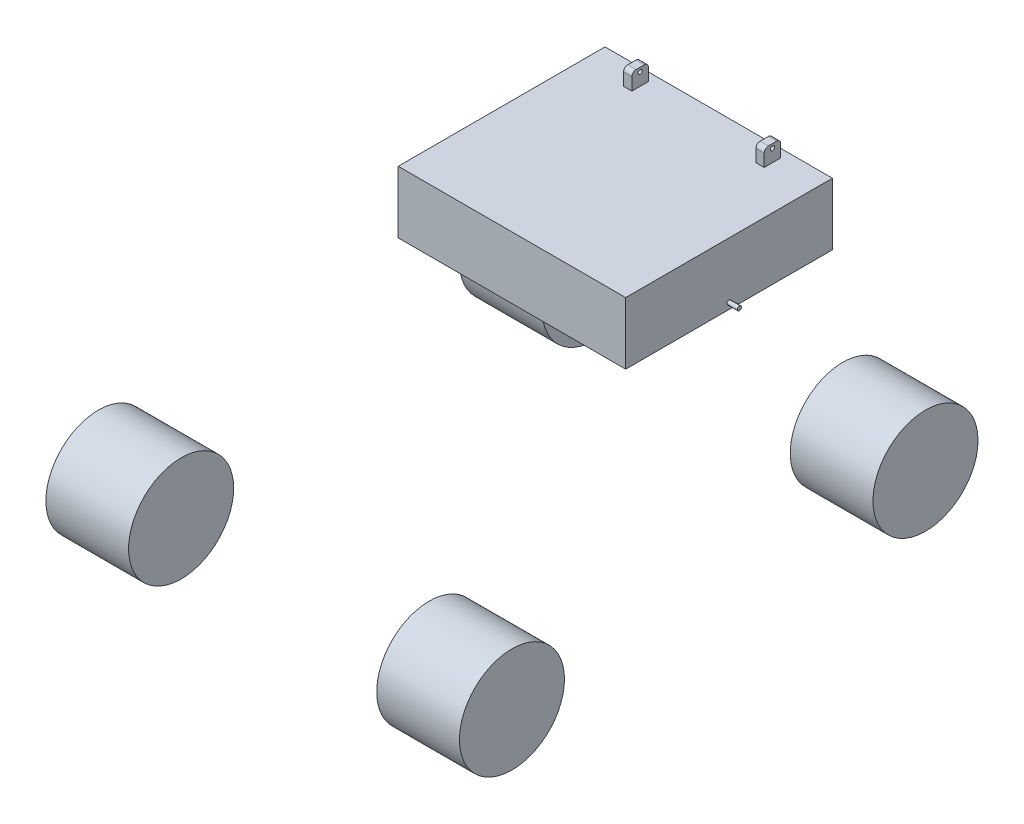
ISO-10303-21;
HEADER;
FILE_DESCRIPTION(('STEP AP214'),'2;1');
FILE_NAME('part.step','',(''),(''),'','','');
FILE_SCHEMA(('AUTOMOTIVE_DESIGN { 1 0 10303 214 1 1 1 1 }'));
ENDSEC;
DATA;
#1=APPLICATION_CONTEXT('core data for automotive mechanical design processes');
#2=APPLICATION_PROTOCOL_DEFINITION('international standard','automotive_design',2000,#1);
#3=PRODUCT_CONTEXT('',#1,'mechanical');
#4=PRODUCT('Part','Part','',(#3));
#5=PRODUCT_RELATED_PRODUCT_CATEGORY('part','',(#4));
#6=PRODUCT_DEFINITION_FORMATION('','',#4);
#7=PRODUCT_DEFINITION_CONTEXT('part definition',#1,'design');
#8=PRODUCT_DEFINITION('design','',#6,#7);
#9=PRODUCT_DEFINITION_SHAPE('','',#8);
#10=(LENGTH_UNIT() NAMED_UNIT(*) SI_UNIT(.MILLI.,.METRE.));
#11=(NAMED_UNIT(*) PLANE_ANGLE_UNIT() SI_UNIT($,.RADIAN.));
#12=(NAMED_UNIT(*) SI_UNIT($,.STERADIAN.) SOLID_ANGLE_UNIT());
#13=UNCERTAINTY_MEASURE_WITH_UNIT(LENGTH_MEASURE(1.E-05),#10,'distance_accuracy_value','');
#14=(GEOMETRIC_REPRESENTATION_CONTEXT(3) GLOBAL_UNCERTAINTY_ASSIGNED_CONTEXT((#13)) GLOBAL_UNIT_ASSIGNED_CONTEXT((#10,
#11,#12)) REPRESENTATION_CONTEXT('',''));
#15=CARTESIAN_POINT('',(0.,0.,0.));
#16=DIRECTION('',(0.,0.,1.));
#17=DIRECTION('',(1.,0.,0.));
#18=AXIS2_PLACEMENT_3D('',#15,#16,#17);
#19=CARTESIAN_POINT('',(275.,500.,0.));
#20=DIRECTION('',(0.,-1.,0.));
#21=DIRECTION('',(0.,0.,-1.));
#22=AXIS2_PLACEMENT_3D('',#19,#20,#21);
#23=PLANE('',#22);
#24=DIRECTION('',(0.,0.,1.));
#25=VECTOR('',#24,1.);
#26=CARTESIAN_POINT('',(-170.,500.,-440.));
#27=LINE('',#26,#25);
#28=CARTESIAN_POINT('',(-170.,500.,-480.));
#29=VERTEX_POINT('',#28);
#30=CARTESIAN_POINT('',(-170.,500.,-440.));
#31=VERTEX_POINT('',#30);
#32=EDGE_CURVE('E183',#29,#31,#27,.T.);
#33=ORIENTED_EDGE('',*,*,#32,.F.);
#34=DIRECTION('',(-1.,0.,0.));
#35=VECTOR('',#34,1.);
#36=CARTESIAN_POINT('',(-170.,500.,-480.));
#37=LINE('',#36,#35);
#38=CARTESIAN_POINT('',(-150.,500.,-480.));
#39=VERTEX_POINT('',#38);
#40=EDGE_CURVE('E202',#39,#29,#37,.T.);
#41=ORIENTED_EDGE('',*,*,#40,.F.);
#42=DIRECTION('',(0.,0.,-1.));
#43=VECTOR('',#42,1.);
#44=CARTESIAN_POINT('',(-150.,500.,-440.));
#45=LINE('',#44,#43);
#46=CARTESIAN_POINT('',(-150.,500.,-440.));
#47=VERTEX_POINT('',#46);
#48=EDGE_CURVE('E211',#47,#39,#45,.T.);
#49=ORIENTED_EDGE('',*,*,#48,.F.);
#50=DIRECTION('',(1.,0.,0.));
#51=VECTOR('',#50,1.);
#52=CARTESIAN_POINT('',(-170.,500.,-440.));
#53=LINE('',#52,#51);
#54=EDGE_CURVE('E208',#31,#47,#53,.T.);
#55=ORIENTED_EDGE('',*,*,#54,.F.);
#56=EDGE_LOOP('',(#33,#41,#49,#55));
#57=FACE_BOUND('',#56,.T.);
#58=DIRECTION('',(0.,0.,1.));
#59=VECTOR('',#58,1.);
#60=CARTESIAN_POINT('',(-275.,500.,0.));
#61=LINE('',#60,#59);
#62=CARTESIAN_POINT('',(-275.,500.,-500.));
#63=VERTEX_POINT('',#62);
#64=CARTESIAN_POINT('',(-275.,500.,0.));
#65=VERTEX_POINT('',#64);
#66=EDGE_CURVE('E237',#63,#65,#61,.T.);
#67=ORIENTED_EDGE('',*,*,#66,.T.);
#68=DIRECTION('',(-1.,0.,0.));
#69=VECTOR('',#68,1.);
#70=CARTESIAN_POINT('',(275.,500.,0.));
#71=LINE('',#70,#69);
#72=CARTESIAN_POINT('',(275.,500.,0.));
#73=VERTEX_POINT('',#72);
#74=EDGE_CURVE('E243',#73,#65,#71,.T.);
#75=ORIENTED_EDGE('',*,*,#74,.F.);
#76=DIRECTION('',(0.,0.,1.));
#77=VECTOR('',#76,1.);
#78=CARTESIAN_POINT('',(275.,500.,0.));
#79=LINE('',#78,#77);
#80=CARTESIAN_POINT('',(275.,500.,-500.));
#81=VERTEX_POINT('',#80);
#82=EDGE_CURVE('E241',#81,#73,#79,.T.);
#83=ORIENTED_EDGE('',*,*,#82,.F.);
#84=DIRECTION('',(-1.,0.,0.));
#85=VECTOR('',#84,1.);
#86=CARTESIAN_POINT('',(275.,500.,-500.));
#87=LINE('',#86,#85);
#88=EDGE_CURVE('E253',#81,#63,#87,.T.);
#89=ORIENTED_EDGE('',*,*,#88,.T.);
#90=EDGE_LOOP('',(#67,#75,#83,#89));
#91=FACE_BOUND('',#90,.T.);
#92=DIRECTION('',(0.,0.,1.));
#93=VECTOR('',#92,1.);
#94=CARTESIAN_POINT('',(150.,500.,-440.));
#95=LINE('',#94,#93);
#96=CARTESIAN_POINT('',(150.,500.,-480.));
#97=VERTEX_POINT('',#96);
#98=CARTESIAN_POINT('',(150.,500.,-440.));
#99=VERTEX_POINT('',#98);
#100=EDGE_CURVE('E166',#97,#99,#95,.T.);
#101=ORIENTED_EDGE('',*,*,#100,.F.);
#102=DIRECTION('',(-1.,0.,0.));
#103=VECTOR('',#102,1.);
#104=CARTESIAN_POINT('',(150.,500.,-480.));
#105=LINE('',#104,#103);
#106=CARTESIAN_POINT('',(170.,500.,-480.));
#107=VERTEX_POINT('',#106);
#108=EDGE_CURVE('E179',#107,#97,#105,.T.);
#109=ORIENTED_EDGE('',*,*,#108,.F.);
#110=DIRECTION('',(0.,0.,-1.));
#111=VECTOR('',#110,1.);
#112=CARTESIAN_POINT('',(170.,500.,-440.));
#113=LINE('',#112,#111);
#114=CARTESIAN_POINT('',(170.,500.,-440.));
#115=VERTEX_POINT('',#114);
#116=EDGE_CURVE('E187',#115,#107,#113,.T.);
#117=ORIENTED_EDGE('',*,*,#116,.F.);
#118=DIRECTION('',(1.,0.,0.));
#119=VECTOR('',#118,1.);
#120=CARTESIAN_POINT('',(150.,500.,-440.));
#121=LINE('',#120,#119);
#122=EDGE_CURVE('E182',#99,#115,#121,.T.);
#123=ORIENTED_EDGE('',*,*,#122,.F.);
#124=EDGE_LOOP('',(#101,#109,#117,#123));
#125=FACE_BOUND('',#124,.T.);
#126=ADVANCED_FACE('F49',(#57,#91,#125),#23,.F.);
#127=CARTESIAN_POINT('',(275.,500.,0.));
#128=DIRECTION('',(0.,0.,-1.));
#129=DIRECTION('',(0.,1.,0.));
#130=AXIS2_PLACEMENT_3D('',#127,#128,#129);
#131=PLANE('',#130);
#132=DIRECTION('',(0.,-1.,0.));
#133=VECTOR('',#132,1.);
#134=CARTESIAN_POINT('',(-275.,500.,0.));
#135=LINE('',#134,#133);
#136=CARTESIAN_POINT('',(-275.,350.,0.));
#137=VERTEX_POINT('',#136);
#138=EDGE_CURVE('E232',#65,#137,#135,.T.);
#139=ORIENTED_EDGE('',*,*,#138,.T.);
#140=DIRECTION('',(-1.,0.,0.));
#141=VECTOR('',#140,1.);
#142=CARTESIAN_POINT('',(275.,350.,0.));
#143=LINE('',#142,#141);
#144=CARTESIAN_POINT('',(275.,350.,0.));
#145=VERTEX_POINT('',#144);
#146=EDGE_CURVE('E259',#145,#137,#143,.T.);
#147=ORIENTED_EDGE('',*,*,#146,.F.);
#148=DIRECTION('',(0.,-1.,0.));
#149=VECTOR('',#148,1.);
#150=CARTESIAN_POINT('',(275.,500.,0.));
#151=LINE('',#150,#149);
#152=EDGE_CURVE('E233',#73,#145,#151,.T.);
#153=ORIENTED_EDGE('',*,*,#152,.F.);
#154=ORIENTED_EDGE('',*,*,#74,.T.);
#155=EDGE_LOOP('',(#139,#147,#153,#154));
#156=FACE_BOUND('',#155,.T.);
#157=ADVANCED_FACE('F328',(#156),#131,.F.);
#158=CARTESIAN_POINT('',(275.,350.,0.));
#159=DIRECTION('',(0.,1.,0.));
#160=DIRECTION('',(0.,0.,1.));
#161=AXIS2_PLACEMENT_3D('',#158,#159,#160);
#162=PLANE('',#161);
#163=DIRECTION('',(0.,0.,-1.));
#164=VECTOR('',#163,1.);
#165=CARTESIAN_POINT('',(-275.,350.,0.));
#166=LINE('',#165,#164);
#167=CARTESIAN_POINT('',(-275.,350.,-500.));
#168=VERTEX_POINT('',#167);
#169=EDGE_CURVE('E246',#137,#168,#166,.T.);
#170=ORIENTED_EDGE('',*,*,#169,.T.);
#171=DIRECTION('',(-1.,0.,0.));
#172=VECTOR('',#171,1.);
#173=CARTESIAN_POINT('',(275.,350.,-500.));
#174=LINE('',#173,#172);
#175=CARTESIAN_POINT('',(275.,350.,-500.));
#176=VERTEX_POINT('',#175);
#177=EDGE_CURVE('E256',#176,#168,#174,.T.);
#178=ORIENTED_EDGE('',*,*,#177,.F.);
#179=DIRECTION('',(0.,0.,-1.));
#180=VECTOR('',#179,1.);
#181=CARTESIAN_POINT('',(275.,350.,0.));
#182=LINE('',#181,#180);
#183=EDGE_CURVE('E236',#145,#176,#182,.T.);
#184=ORIENTED_EDGE('',*,*,#183,.F.);
#185=ORIENTED_EDGE('',*,*,#146,.T.);
#186=EDGE_LOOP('',(#170,#178,#184,#185));
#187=FACE_BOUND('',#186,.T.);
#188=ADVANCED_FACE('F333',(#187),#162,.F.);
#189=CARTESIAN_POINT('',(275.,500.,-500.));
#190=DIRECTION('',(0.,0.,1.));
#191=DIRECTION('',(0.,-1.,0.));
#192=AXIS2_PLACEMENT_3D('',#189,#190,#191);
#193=PLANE('',#192);
#194=DIRECTION('',(0.,1.,0.));
#195=VECTOR('',#194,1.);
#196=CARTESIAN_POINT('',(-275.,500.,-500.));
#197=LINE('',#196,#195);
#198=EDGE_CURVE('E248',#168,#63,#197,.T.);
#199=ORIENTED_EDGE('',*,*,#198,.T.);
#200=ORIENTED_EDGE('',*,*,#88,.F.);
#201=DIRECTION('',(0.,1.,0.));
#202=VECTOR('',#201,1.);
#203=CARTESIAN_POINT('',(275.,500.,-500.));
#204=LINE('',#203,#202);
#205=EDGE_CURVE('E239',#176,#81,#204,.T.);
#206=ORIENTED_EDGE('',*,*,#205,.F.);
#207=ORIENTED_EDGE('',*,*,#177,.T.);
#208=EDGE_LOOP('',(#199,#200,#206,#207));
#209=FACE_BOUND('',#208,.T.);
#210=ADVANCED_FACE('F340',(#209),#193,.F.);
#211=CARTESIAN_POINT('',(275.,0.,0.));
#212=DIRECTION('',(1.,0.,0.));
#213=DIRECTION('',(0.,0.,-1.));
#214=AXIS2_PLACEMENT_3D('',#211,#212,#213);
#215=PLANE('',#214);
#216=CARTESIAN_POINT('',(275.,365.,-250.));
#217=DIRECTION('',(1.,0.,0.));
#218=DIRECTION('',(0.,0.,-1.));
#219=AXIS2_PLACEMENT_3D('',#216,#217,#218);
#220=CIRCLE('',#219,4.99999999999997);
#221=CARTESIAN_POINT('',(275.,365.,-255.));
#222=VERTEX_POINT('',#221);
#223=EDGE_CURVE('E226',#222,#222,#220,.T.);
#224=ORIENTED_EDGE('',*,*,#223,.F.);
#225=EDGE_LOOP('',(#224));
#226=FACE_BOUND('',#225,.T.);
#227=ORIENTED_EDGE('',*,*,#152,.T.);
#228=ORIENTED_EDGE('',*,*,#183,.T.);
#229=ORIENTED_EDGE('',*,*,#205,.T.);
#230=ORIENTED_EDGE('',*,*,#82,.T.);
#231=EDGE_LOOP('',(#227,#228,#229,#230));
#232=FACE_BOUND('',#231,.T.);
#233=ADVANCED_FACE('F343',(#226,#232),#215,.T.);
#234=CARTESIAN_POINT('',(-275.,0.,0.));
#235=DIRECTION('',(1.,0.,0.));
#236=DIRECTION('',(0.,0.,-1.));
#237=AXIS2_PLACEMENT_3D('',#234,#235,#236);
#238=PLANE('',#237);
#239=CARTESIAN_POINT('',(-275.,365.,-250.));
#240=DIRECTION('',(1.,0.,0.));
#241=DIRECTION('',(0.,0.,-1.));
#242=AXIS2_PLACEMENT_3D('',#239,#240,#241);
#243=CIRCLE('',#242,4.99999999999997);
#244=CARTESIAN_POINT('',(-275.,365.,-255.));
#245=VERTEX_POINT('',#244);
#246=EDGE_CURVE('E262',#245,#245,#243,.F.);
#247=ORIENTED_EDGE('',*,*,#246,.F.);
#248=EDGE_LOOP('',(#247));
#249=FACE_BOUND('',#248,.T.);
#250=ORIENTED_EDGE('',*,*,#138,.F.);
#251=ORIENTED_EDGE('',*,*,#66,.F.);
#252=ORIENTED_EDGE('',*,*,#198,.F.);
#253=ORIENTED_EDGE('',*,*,#169,.F.);
#254=EDGE_LOOP('',(#250,#251,#252,#253));
#255=FACE_BOUND('',#254,.T.);
#256=ADVANCED_FACE('F338',(#249,#255),#238,.F.);
#257=CARTESIAN_POINT('',(314.142135623731,365.,-250.));
#258=DIRECTION('',(-1.,0.,0.));
#259=DIRECTION('',(0.,0.,1.));
#260=AXIS2_PLACEMENT_3D('',#257,#258,#259);
#261=CYLINDRICAL_SURFACE('',#260,4.99999999999997);
#262=ORIENTED_EDGE('',*,*,#223,.T.);
#263=EDGE_LOOP('',(#262));
#264=FACE_BOUND('',#263,.T.);
#265=CARTESIAN_POINT('',(300.,365.,-250.));
#266=DIRECTION('',(1.,0.,0.));
#267=DIRECTION('',(0.,0.,-1.));
#268=AXIS2_PLACEMENT_3D('',#265,#266,#267);
#269=CIRCLE('',#268,4.99999999999997);
#270=CARTESIAN_POINT('',(300.,365.,-255.));
#271=VERTEX_POINT('',#270);
#272=EDGE_CURVE('E229',#271,#271,#269,.T.);
#273=ORIENTED_EDGE('',*,*,#272,.F.);
#274=EDGE_LOOP('',(#273));
#275=FACE_BOUND('',#274,.T.);
#276=ADVANCED_FACE('F421',(#264,#275),#261,.T.);
#277=CARTESIAN_POINT('',(300.,0.,-500.));
#278=DIRECTION('',(1.,0.,0.));
#279=DIRECTION('',(0.,0.,-1.));
#280=AXIS2_PLACEMENT_3D('',#277,#278,#279);
#281=PLANE('',#280);
#282=ORIENTED_EDGE('',*,*,#272,.T.);
#283=EDGE_LOOP('',(#282));
#284=FACE_BOUND('',#283,.T.);
#285=ADVANCED_FACE('F419',(#284),#281,.T.);
#286=CARTESIAN_POINT('',(-314.142135623731,365.,-250.));
#287=DIRECTION('',(1.,0.,0.));
#288=DIRECTION('',(0.,0.,1.));
#289=AXIS2_PLACEMENT_3D('',#286,#287,#288);
#290=CYLINDRICAL_SURFACE('',#289,4.99999999999997);
#291=ORIENTED_EDGE('',*,*,#246,.T.);
#292=EDGE_LOOP('',(#291));
#293=FACE_BOUND('',#292,.T.);
#294=CARTESIAN_POINT('',(-300.,365.,-250.));
#295=DIRECTION('',(1.,0.,0.));
#296=DIRECTION('',(0.,0.,-1.));
#297=AXIS2_PLACEMENT_3D('',#294,#295,#296);
#298=CIRCLE('',#297,4.99999999999997);
#299=CARTESIAN_POINT('',(-300.,365.,-255.));
#300=VERTEX_POINT('',#299);
#301=EDGE_CURVE('E223',#300,#300,#298,.T.);
#302=ORIENTED_EDGE('',*,*,#301,.T.);
#303=EDGE_LOOP('',(#302));
#304=FACE_BOUND('',#303,.T.);
#305=ADVANCED_FACE('F415',(#293,#304),#290,.T.);
#306=CARTESIAN_POINT('',(-300.,0.,-500.));
#307=DIRECTION('',(-1.,0.,0.));
#308=DIRECTION('',(0.,0.,-1.));
#309=AXIS2_PLACEMENT_3D('',#306,#307,#308);
#310=PLANE('',#309);
#311=ORIENTED_EDGE('',*,*,#301,.F.);
#312=EDGE_LOOP('',(#311));
#313=FACE_BOUND('',#312,.T.);
#314=ADVANCED_FACE('F411',(#313),#310,.T.);
#315=CARTESIAN_POINT('',(-170.,540.,-440.));
#316=DIRECTION('',(1.,0.,0.));
#317=DIRECTION('',(0.,0.,-1.));
#318=AXIS2_PLACEMENT_3D('',#315,#316,#317);
#319=PLANE('',#318);
#320=CARTESIAN_POINT('',(-170.,530.,-460.));
#321=DIRECTION('',(1.,0.,0.));
#322=DIRECTION('',(0.,0.,-1.));
#323=AXIS2_PLACEMENT_3D('',#320,#321,#322);
#324=CIRCLE('',#323,4.99999999999999);
#325=CARTESIAN_POINT('',(-170.,530.,-465.));
#326=VERTEX_POINT('',#325);
#327=EDGE_CURVE('E372',#326,#326,#324,.T.);
#328=ORIENTED_EDGE('',*,*,#327,.T.);
#329=EDGE_LOOP('',(#328));
#330=FACE_BOUND('',#329,.T.);
#331=DIRECTION('',(0.,-1.,0.));
#332=VECTOR('',#331,1.);
#333=CARTESIAN_POINT('',(-170.,540.,-440.));
#334=LINE('',#333,#332);
#335=CARTESIAN_POINT('',(-170.,530.,-440.));
#336=VERTEX_POINT('',#335);
#337=EDGE_CURVE('E221',#336,#31,#334,.T.);
#338=ORIENTED_EDGE('',*,*,#337,.F.);
#339=CARTESIAN_POINT('',(-170.,530.,-450.));
#340=DIRECTION('',(1.,0.,0.));
#341=DIRECTION('',(0.,0.,-1.));
#342=AXIS2_PLACEMENT_3D('',#339,#340,#341);
#343=CIRCLE('',#342,10.);
#344=CARTESIAN_POINT('',(-170.,540.,-450.));
#345=VERTEX_POINT('',#344);
#346=EDGE_CURVE('E57',#336,#345,#343,.F.);
#347=ORIENTED_EDGE('',*,*,#346,.T.);
#348=DIRECTION('',(0.,0.,1.));
#349=VECTOR('',#348,1.);
#350=CARTESIAN_POINT('',(-170.,540.,-440.));
#351=LINE('',#350,#349);
#352=CARTESIAN_POINT('',(-170.,540.,-470.));
#353=VERTEX_POINT('',#352);
#354=EDGE_CURVE('E198',#353,#345,#351,.T.);
#355=ORIENTED_EDGE('',*,*,#354,.F.);
#356=CARTESIAN_POINT('',(-170.,530.,-470.));
#357=DIRECTION('',(1.,0.,0.));
#358=DIRECTION('',(0.,0.,-1.));
#359=AXIS2_PLACEMENT_3D('',#356,#357,#358);
#360=CIRCLE('',#359,10.);
#361=CARTESIAN_POINT('',(-170.,530.,-480.));
#362=VERTEX_POINT('',#361);
#363=EDGE_CURVE('E64',#353,#362,#360,.F.);
#364=ORIENTED_EDGE('',*,*,#363,.T.);
#365=DIRECTION('',(0.,-1.,0.));
#366=VECTOR('',#365,1.);
#367=CARTESIAN_POINT('',(-170.,540.,-480.));
#368=LINE('',#367,#366);
#369=EDGE_CURVE('E205',#362,#29,#368,.T.);
#370=ORIENTED_EDGE('',*,*,#369,.T.);
#371=ORIENTED_EDGE('',*,*,#32,.T.);
#372=EDGE_LOOP('',(#338,#347,#355,#364,#370,#371));
#373=FACE_BOUND('',#372,.T.);
#374=ADVANCED_FACE('F294',(#330,#373),#319,.F.);
#375=CARTESIAN_POINT('',(-170.,540.,-440.));
#376=DIRECTION('',(0.,0.,-1.));
#377=DIRECTION('',(0.,1.,0.));
#378=AXIS2_PLACEMENT_3D('',#375,#376,#377);
#379=PLANE('',#378);
#380=DIRECTION('',(0.,-1.,0.));
#381=VECTOR('',#380,1.);
#382=CARTESIAN_POINT('',(-150.,540.,-440.));
#383=LINE('',#382,#381);
#384=CARTESIAN_POINT('',(-150.,530.,-440.));
#385=VERTEX_POINT('',#384);
#386=EDGE_CURVE('E219',#385,#47,#383,.T.);
#387=ORIENTED_EDGE('',*,*,#386,.F.);
#388=DIRECTION('',(1.,0.,0.));
#389=VECTOR('',#388,1.);
#390=CARTESIAN_POINT('',(-170.,530.,-440.));
#391=LINE('',#390,#389);
#392=EDGE_CURVE('E72',#385,#336,#391,.F.);
#393=ORIENTED_EDGE('',*,*,#392,.T.);
#394=ORIENTED_EDGE('',*,*,#337,.T.);
#395=ORIENTED_EDGE('',*,*,#54,.T.);
#396=EDGE_LOOP('',(#387,#393,#394,#395));
#397=FACE_BOUND('',#396,.T.);
#398=ADVANCED_FACE('F305',(#397),#379,.F.);
#399=CARTESIAN_POINT('',(-150.,540.,-440.));
#400=DIRECTION('',(-1.,0.,0.));
#401=DIRECTION('',(0.,0.,1.));
#402=AXIS2_PLACEMENT_3D('',#399,#400,#401);
#403=PLANE('',#402);
#404=CARTESIAN_POINT('',(-150.,530.,-460.));
#405=DIRECTION('',(-1.,0.,0.));
#406=DIRECTION('',(0.,0.,1.));
#407=AXIS2_PLACEMENT_3D('',#404,#405,#406);
#408=CIRCLE('',#407,4.99999999999999);
#409=CARTESIAN_POINT('',(-150.,530.,-455.));
#410=VERTEX_POINT('',#409);
#411=EDGE_CURVE('E377',#410,#410,#408,.T.);
#412=ORIENTED_EDGE('',*,*,#411,.T.);
#413=EDGE_LOOP('',(#412));
#414=FACE_BOUND('',#413,.T.);
#415=DIRECTION('',(0.,0.,-1.));
#416=VECTOR('',#415,1.);
#417=CARTESIAN_POINT('',(-150.,540.,-440.));
#418=LINE('',#417,#416);
#419=CARTESIAN_POINT('',(-150.,540.,-450.));
#420=VERTEX_POINT('',#419);
#421=CARTESIAN_POINT('',(-150.,540.,-470.));
#422=VERTEX_POINT('',#421);
#423=EDGE_CURVE('E201',#420,#422,#418,.T.);
#424=ORIENTED_EDGE('',*,*,#423,.F.);
#425=CARTESIAN_POINT('',(-150.,530.,-450.));
#426=DIRECTION('',(-1.,0.,0.));
#427=DIRECTION('',(0.,0.,1.));
#428=AXIS2_PLACEMENT_3D('',#425,#426,#427);
#429=CIRCLE('',#428,10.);
#430=EDGE_CURVE('E290',#420,#385,#429,.F.);
#431=ORIENTED_EDGE('',*,*,#430,.T.);
#432=ORIENTED_EDGE('',*,*,#386,.T.);
#433=ORIENTED_EDGE('',*,*,#48,.T.);
#434=DIRECTION('',(0.,-1.,0.));
#435=VECTOR('',#434,1.);
#436=CARTESIAN_POINT('',(-150.,540.,-480.));
#437=LINE('',#436,#435);
#438=CARTESIAN_POINT('',(-150.,530.,-480.));
#439=VERTEX_POINT('',#438);
#440=EDGE_CURVE('E217',#439,#39,#437,.T.);
#441=ORIENTED_EDGE('',*,*,#440,.F.);
#442=CARTESIAN_POINT('',(-150.,530.,-470.));
#443=DIRECTION('',(-1.,0.,0.));
#444=DIRECTION('',(0.,0.,1.));
#445=AXIS2_PLACEMENT_3D('',#442,#443,#444);
#446=CIRCLE('',#445,10.);
#447=EDGE_CURVE('E288',#439,#422,#446,.F.);
#448=ORIENTED_EDGE('',*,*,#447,.T.);
#449=EDGE_LOOP('',(#424,#431,#432,#433,#441,#448));
#450=FACE_BOUND('',#449,.T.);
#451=ADVANCED_FACE('F303',(#414,#450),#403,.F.);
#452=CARTESIAN_POINT('',(-170.,540.,-480.));
#453=DIRECTION('',(0.,0.,1.));
#454=DIRECTION('',(1.,0.,0.));
#455=AXIS2_PLACEMENT_3D('',#452,#453,#454);
#456=PLANE('',#455);
#457=ORIENTED_EDGE('',*,*,#369,.F.);
#458=DIRECTION('',(-1.,0.,0.));
#459=VECTOR('',#458,1.);
#460=CARTESIAN_POINT('',(-170.,530.,-480.));
#461=LINE('',#460,#459);
#462=EDGE_CURVE('E12',#362,#439,#461,.F.);
#463=ORIENTED_EDGE('',*,*,#462,.T.);
#464=ORIENTED_EDGE('',*,*,#440,.T.);
#465=ORIENTED_EDGE('',*,*,#40,.T.);
#466=EDGE_LOOP('',(#457,#463,#464,#465));
#467=FACE_BOUND('',#466,.T.);
#468=ADVANCED_FACE('F313',(#467),#456,.F.);
#469=CARTESIAN_POINT('',(0.,540.,0.));
#470=DIRECTION('',(0.,-1.,0.));
#471=DIRECTION('',(0.,0.,-1.));
#472=AXIS2_PLACEMENT_3D('',#469,#470,#471);
#473=PLANE('',#472);
#474=ORIENTED_EDGE('',*,*,#354,.T.);
#475=DIRECTION('',(1.,0.,0.));
#476=VECTOR('',#475,1.);
#477=CARTESIAN_POINT('',(0.,540.,-450.));
#478=LINE('',#477,#476);
#479=EDGE_CURVE('E285',#345,#420,#478,.T.);
#480=ORIENTED_EDGE('',*,*,#479,.T.);
#481=ORIENTED_EDGE('',*,*,#423,.T.);
#482=DIRECTION('',(-1.,0.,0.));
#483=VECTOR('',#482,1.);
#484=CARTESIAN_POINT('',(1.30451205393456E-12,540.,-470.));
#485=LINE('',#484,#483);
#486=EDGE_CURVE('E282',#422,#353,#485,.T.);
#487=ORIENTED_EDGE('',*,*,#486,.T.);
#488=EDGE_LOOP('',(#474,#480,#481,#487));
#489=FACE_BOUND('',#488,.T.);
#490=ADVANCED_FACE('F298',(#489),#473,.F.);
#491=CARTESIAN_POINT('',(150.,540.,-440.));
#492=DIRECTION('',(1.,0.,0.));
#493=DIRECTION('',(0.,0.,-1.));
#494=AXIS2_PLACEMENT_3D('',#491,#492,#493);
#495=PLANE('',#494);
#496=CARTESIAN_POINT('',(150.,530.,-460.));
#497=DIRECTION('',(1.,0.,0.));
#498=DIRECTION('',(0.,0.,-1.));
#499=AXIS2_PLACEMENT_3D('',#496,#497,#498);
#500=CIRCLE('',#499,4.99999999999999);
#501=CARTESIAN_POINT('',(150.,530.,-465.));
#502=VERTEX_POINT('',#501);
#503=EDGE_CURVE('E380',#502,#502,#500,.T.);
#504=ORIENTED_EDGE('',*,*,#503,.T.);
#505=EDGE_LOOP('',(#504));
#506=FACE_BOUND('',#505,.T.);
#507=DIRECTION('',(0.,-1.,0.));
#508=VECTOR('',#507,1.);
#509=CARTESIAN_POINT('',(150.,540.,-440.));
#510=LINE('',#509,#508);
#511=CARTESIAN_POINT('',(150.,530.,-440.));
#512=VERTEX_POINT('',#511);
#513=EDGE_CURVE('E370',#512,#99,#510,.T.);
#514=ORIENTED_EDGE('',*,*,#513,.F.);
#515=CARTESIAN_POINT('',(150.,530.,-450.));
#516=DIRECTION('',(1.,0.,0.));
#517=DIRECTION('',(0.,0.,-1.));
#518=AXIS2_PLACEMENT_3D('',#515,#516,#517);
#519=CIRCLE('',#518,10.);
#520=CARTESIAN_POINT('',(150.,540.,-450.));
#521=VERTEX_POINT('',#520);
#522=EDGE_CURVE('E278',#512,#521,#519,.F.);
#523=ORIENTED_EDGE('',*,*,#522,.T.);
#524=DIRECTION('',(0.,0.,1.));
#525=VECTOR('',#524,1.);
#526=CARTESIAN_POINT('',(150.,540.,-440.));
#527=LINE('',#526,#525);
#528=CARTESIAN_POINT('',(150.,540.,-470.));
#529=VERTEX_POINT('',#528);
#530=EDGE_CURVE('E188',#529,#521,#527,.T.);
#531=ORIENTED_EDGE('',*,*,#530,.F.);
#532=CARTESIAN_POINT('',(150.,530.,-470.));
#533=DIRECTION('',(1.,0.,0.));
#534=DIRECTION('',(0.,0.,-1.));
#535=AXIS2_PLACEMENT_3D('',#532,#533,#534);
#536=CIRCLE('',#535,10.);
#537=CARTESIAN_POINT('',(150.,530.,-480.));
#538=VERTEX_POINT('',#537);
#539=EDGE_CURVE('E168',#529,#538,#536,.F.);
#540=ORIENTED_EDGE('',*,*,#539,.T.);
#541=DIRECTION('',(0.,-1.,0.));
#542=VECTOR('',#541,1.);
#543=CARTESIAN_POINT('',(150.,540.,-480.));
#544=LINE('',#543,#542);
#545=EDGE_CURVE('E162',#538,#97,#544,.T.);
#546=ORIENTED_EDGE('',*,*,#545,.T.);
#547=ORIENTED_EDGE('',*,*,#100,.T.);
#548=EDGE_LOOP('',(#514,#523,#531,#540,#546,#547));
#549=FACE_BOUND('',#548,.T.);
#550=ADVANCED_FACE('F165',(#506,#549),#495,.F.);
#551=CARTESIAN_POINT('',(150.,540.,-440.));
#552=DIRECTION('',(0.,0.,-1.));
#553=DIRECTION('',(0.,1.,0.));
#554=AXIS2_PLACEMENT_3D('',#551,#552,#553);
#555=PLANE('',#554);
#556=DIRECTION('',(0.,-1.,0.));
#557=VECTOR('',#556,1.);
#558=CARTESIAN_POINT('',(170.,540.,-440.));
#559=LINE('',#558,#557);
#560=CARTESIAN_POINT('',(170.,530.,-440.));
#561=VERTEX_POINT('',#560);
#562=EDGE_CURVE('E367',#561,#115,#559,.T.);
#563=ORIENTED_EDGE('',*,*,#562,.F.);
#564=DIRECTION('',(1.,0.,0.));
#565=VECTOR('',#564,1.);
#566=CARTESIAN_POINT('',(150.,530.,-440.));
#567=LINE('',#566,#565);
#568=EDGE_CURVE('E275',#561,#512,#567,.F.);
#569=ORIENTED_EDGE('',*,*,#568,.T.);
#570=ORIENTED_EDGE('',*,*,#513,.T.);
#571=ORIENTED_EDGE('',*,*,#122,.T.);
#572=EDGE_LOOP('',(#563,#569,#570,#571));
#573=FACE_BOUND('',#572,.T.);
#574=ADVANCED_FACE('F369',(#573),#555,.F.);
#575=CARTESIAN_POINT('',(170.,540.,-440.));
#576=DIRECTION('',(-1.,0.,0.));
#577=DIRECTION('',(0.,0.,1.));
#578=AXIS2_PLACEMENT_3D('',#575,#576,#577);
#579=PLANE('',#578);
#580=CARTESIAN_POINT('',(170.,530.,-460.));
#581=DIRECTION('',(1.,0.,0.));
#582=DIRECTION('',(0.,0.,-1.));
#583=AXIS2_PLACEMENT_3D('',#580,#581,#582);
#584=CIRCLE('',#583,4.99999999999999);
#585=CARTESIAN_POINT('',(170.,530.,-465.));
#586=VERTEX_POINT('',#585);
#587=EDGE_CURVE('E383',#586,#586,#584,.T.);
#588=ORIENTED_EDGE('',*,*,#587,.F.);
#589=EDGE_LOOP('',(#588));
#590=FACE_BOUND('',#589,.T.);
#591=DIRECTION('',(0.,0.,-1.));
#592=VECTOR('',#591,1.);
#593=CARTESIAN_POINT('',(170.,540.,-440.));
#594=LINE('',#593,#592);
#595=CARTESIAN_POINT('',(170.,540.,-450.));
#596=VERTEX_POINT('',#595);
#597=CARTESIAN_POINT('',(170.,540.,-470.));
#598=VERTEX_POINT('',#597);
#599=EDGE_CURVE('E172',#596,#598,#594,.T.);
#600=ORIENTED_EDGE('',*,*,#599,.F.);
#601=CARTESIAN_POINT('',(170.,530.,-450.));
#602=DIRECTION('',(-1.,0.,0.));
#603=DIRECTION('',(0.,0.,1.));
#604=AXIS2_PLACEMENT_3D('',#601,#602,#603);
#605=CIRCLE('',#604,10.);
#606=EDGE_CURVE('E273',#596,#561,#605,.F.);
#607=ORIENTED_EDGE('',*,*,#606,.T.);
#608=ORIENTED_EDGE('',*,*,#562,.T.);
#609=ORIENTED_EDGE('',*,*,#116,.T.);
#610=DIRECTION('',(0.,-1.,0.));
#611=VECTOR('',#610,1.);
#612=CARTESIAN_POINT('',(170.,540.,-480.));
#613=LINE('',#612,#611);
#614=CARTESIAN_POINT('',(170.,530.,-480.));
#615=VERTEX_POINT('',#614);
#616=EDGE_CURVE('E173',#615,#107,#613,.T.);
#617=ORIENTED_EDGE('',*,*,#616,.F.);
#618=CARTESIAN_POINT('',(170.,530.,-470.));
#619=DIRECTION('',(-1.,0.,0.));
#620=DIRECTION('',(0.,0.,1.));
#621=AXIS2_PLACEMENT_3D('',#618,#619,#620);
#622=CIRCLE('',#621,10.);
#623=EDGE_CURVE('E271',#615,#598,#622,.F.);
#624=ORIENTED_EDGE('',*,*,#623,.T.);
#625=EDGE_LOOP('',(#600,#607,#608,#609,#617,#624));
#626=FACE_BOUND('',#625,.T.);
#627=ADVANCED_FACE('F361',(#590,#626),#579,.F.);
#628=CARTESIAN_POINT('',(150.,540.,-480.));
#629=DIRECTION('',(0.,0.,1.));
#630=DIRECTION('',(0.,-1.,0.));
#631=AXIS2_PLACEMENT_3D('',#628,#629,#630);
#632=PLANE('',#631);
#633=ORIENTED_EDGE('',*,*,#545,.F.);
#634=DIRECTION('',(-1.,0.,0.));
#635=VECTOR('',#634,1.);
#636=CARTESIAN_POINT('',(150.,530.,-480.));
#637=LINE('',#636,#635);
#638=EDGE_CURVE('E280',#538,#615,#637,.F.);
#639=ORIENTED_EDGE('',*,*,#638,.T.);
#640=ORIENTED_EDGE('',*,*,#616,.T.);
#641=ORIENTED_EDGE('',*,*,#108,.T.);
#642=EDGE_LOOP('',(#633,#639,#640,#641));
#643=FACE_BOUND('',#642,.T.);
#644=ADVANCED_FACE('F185',(#643),#632,.F.);
#645=CARTESIAN_POINT('',(0.,540.,0.));
#646=DIRECTION('',(0.,-1.,0.));
#647=DIRECTION('',(0.,0.,-1.));
#648=AXIS2_PLACEMENT_3D('',#645,#646,#647);
#649=PLANE('',#648);
#650=ORIENTED_EDGE('',*,*,#530,.T.);
#651=DIRECTION('',(1.,0.,0.));
#652=VECTOR('',#651,1.);
#653=CARTESIAN_POINT('',(0.,540.,-450.));
#654=LINE('',#653,#652);
#655=EDGE_CURVE('E268',#521,#596,#654,.T.);
#656=ORIENTED_EDGE('',*,*,#655,.T.);
#657=ORIENTED_EDGE('',*,*,#599,.T.);
#658=DIRECTION('',(-1.,0.,0.));
#659=VECTOR('',#658,1.);
#660=CARTESIAN_POINT('',(0.,540.,-470.));
#661=LINE('',#660,#659);
#662=EDGE_CURVE('E265',#598,#529,#661,.T.);
#663=ORIENTED_EDGE('',*,*,#662,.T.);
#664=EDGE_LOOP('',(#650,#656,#657,#663));
#665=FACE_BOUND('',#664,.T.);
#666=ADVANCED_FACE('F351',(#665),#649,.F.);
#667=CARTESIAN_POINT('',(0.,530.,-450.));
#668=DIRECTION('',(1.,0.,0.));
#669=DIRECTION('',(0.,0.,-1.));
#670=AXIS2_PLACEMENT_3D('',#667,#668,#669);
#671=CYLINDRICAL_SURFACE('',#670,10.);
#672=ORIENTED_EDGE('',*,*,#522,.F.);
#673=ORIENTED_EDGE('',*,*,#568,.F.);
#674=ORIENTED_EDGE('',*,*,#606,.F.);
#675=ORIENTED_EDGE('',*,*,#655,.F.);
#676=EDGE_LOOP('',(#672,#673,#674,#675));
#677=FACE_BOUND('',#676,.T.);
#678=ADVANCED_FACE('F348',(#677),#671,.T.);
#679=CARTESIAN_POINT('',(0.,530.,-470.));
#680=DIRECTION('',(-1.,0.,0.));
#681=DIRECTION('',(0.,0.,1.));
#682=AXIS2_PLACEMENT_3D('',#679,#680,#681);
#683=CYLINDRICAL_SURFACE('',#682,10.);
#684=ORIENTED_EDGE('',*,*,#623,.F.);
#685=ORIENTED_EDGE('',*,*,#638,.F.);
#686=ORIENTED_EDGE('',*,*,#539,.F.);
#687=ORIENTED_EDGE('',*,*,#662,.F.);
#688=EDGE_LOOP('',(#684,#685,#686,#687));
#689=FACE_BOUND('',#688,.T.);
#690=ADVANCED_FACE('F326',(#689),#683,.T.);
#691=CARTESIAN_POINT('',(0.,530.,-450.));
#692=DIRECTION('',(1.,0.,0.));
#693=DIRECTION('',(0.,0.,-1.));
#694=AXIS2_PLACEMENT_3D('',#691,#692,#693);
#695=CYLINDRICAL_SURFACE('',#694,10.);
#696=ORIENTED_EDGE('',*,*,#346,.F.);
#697=ORIENTED_EDGE('',*,*,#392,.F.);
#698=ORIENTED_EDGE('',*,*,#430,.F.);
#699=ORIENTED_EDGE('',*,*,#479,.F.);
#700=EDGE_LOOP('',(#696,#697,#698,#699));
#701=FACE_BOUND('',#700,.T.);
#702=ADVANCED_FACE('F301',(#701),#695,.T.);
#703=CARTESIAN_POINT('',(1.30451205393456E-12,530.,-470.));
#704=DIRECTION('',(-1.,0.,0.));
#705=DIRECTION('',(0.,0.,1.));
#706=AXIS2_PLACEMENT_3D('',#703,#704,#705);
#707=CYLINDRICAL_SURFACE('',#706,10.);
#708=ORIENTED_EDGE('',*,*,#447,.F.);
#709=ORIENTED_EDGE('',*,*,#462,.F.);
#710=ORIENTED_EDGE('',*,*,#363,.F.);
#711=ORIENTED_EDGE('',*,*,#486,.F.);
#712=EDGE_LOOP('',(#708,#709,#710,#711));
#713=FACE_BOUND('',#712,.T.);
#714=ADVANCED_FACE('F51',(#713),#707,.T.);
#715=CARTESIAN_POINT('',(-500.,530.,-460.));
#716=DIRECTION('',(1.,0.,0.));
#717=DIRECTION('',(0.,0.,-1.));
#718=AXIS2_PLACEMENT_3D('',#715,#716,#717);
#719=CYLINDRICAL_SURFACE('',#718,4.99999999999999);
#720=ORIENTED_EDGE('',*,*,#587,.T.);
#721=EDGE_LOOP('',(#720));
#722=FACE_BOUND('',#721,.T.);
#723=ORIENTED_EDGE('',*,*,#503,.F.);
#724=EDGE_LOOP('',(#723));
#725=FACE_BOUND('',#724,.T.);
#726=ADVANCED_FACE('F318',(#722,#725),#719,.F.);
#727=ORIENTED_EDGE('',*,*,#411,.F.);
#728=EDGE_LOOP('',(#727));
#729=FACE_BOUND('',#728,.T.);
#730=ORIENTED_EDGE('',*,*,#327,.F.);
#731=EDGE_LOOP('',(#730));
#732=FACE_BOUND('',#731,.T.);
#733=ADVANCED_FACE('F323',(#729,#732),#719,.F.);
#734=CLOSED_SHELL('',(#126,#157,#188,#210,#233,#256,#276,#285,#305,#314,#374,#398,#451,#468,
#490,#550,#574,#627,#644,#666,#678,#690,#702,#714,#726,#733));
#735=MANIFOLD_SOLID_BREP('B2',#734);
#736=CARTESIAN_POINT('',(-500.,0.,-500.));
#737=DIRECTION('',(1.,0.,0.));
#738=DIRECTION('',(0.,0.,1.));
#739=AXIS2_PLACEMENT_3D('',#736,#737,#738);
#740=CYLINDRICAL_SURFACE('',#739,127.);
#741=CARTESIAN_POINT('',(-500.,0.,-500.));
#742=DIRECTION('',(1.,0.,0.));
#743=DIRECTION('',(0.,0.,-1.));
#744=AXIS2_PLACEMENT_3D('',#741,#742,#743);
#745=CIRCLE('',#744,127.);
#746=CARTESIAN_POINT('',(-500.,0.,-627.));
#747=VERTEX_POINT('',#746);
#748=EDGE_CURVE('E671',#747,#747,#745,.T.);
#749=ORIENTED_EDGE('',*,*,#748,.T.);
#750=EDGE_LOOP('',(#749));
#751=FACE_BOUND('',#750,.T.);
#752=CARTESIAN_POINT('',(-300.,0.,-500.));
#753=DIRECTION('',(1.,0.,0.));
#754=DIRECTION('',(0.,0.,-1.));
#755=AXIS2_PLACEMENT_3D('',#752,#753,#754);
#756=CIRCLE('',#755,127.);
#757=CARTESIAN_POINT('',(-300.,0.,-627.));
#758=VERTEX_POINT('',#757);
#759=EDGE_CURVE('E48',#758,#758,#756,.T.);
#760=ORIENTED_EDGE('',*,*,#759,.F.);
#761=EDGE_LOOP('',(#760));
#762=FACE_BOUND('',#761,.T.);
#763=ADVANCED_FACE('F667',(#751,#762),#740,.T.);
#764=CARTESIAN_POINT('',(-500.,0.,-500.));
#765=DIRECTION('',(-1.,0.,0.));
#766=DIRECTION('',(0.,0.,-1.));
#767=AXIS2_PLACEMENT_3D('',#764,#765,#766);
#768=PLANE('',#767);
#769=ORIENTED_EDGE('',*,*,#748,.F.);
#770=EDGE_LOOP('',(#769));
#771=FACE_BOUND('',#770,.T.);
#772=ADVANCED_FACE('F669',(#771),#768,.T.);
#773=CARTESIAN_POINT('',(-300.,0.,-500.));
#774=DIRECTION('',(-1.,0.,0.));
#775=DIRECTION('',(0.,0.,-1.));
#776=AXIS2_PLACEMENT_3D('',#773,#774,#775);
#777=PLANE('',#776);
#778=ORIENTED_EDGE('',*,*,#759,.T.);
#779=EDGE_LOOP('',(#778));
#780=FACE_BOUND('',#779,.T.);
#781=ADVANCED_FACE('F683',(#780),#777,.F.);
#782=CLOSED_SHELL('',(#763,#772,#781));
#783=MANIFOLD_SOLID_BREP('B6',#782);
#784=CARTESIAN_POINT('',(-500.,0.,500.));
#785=DIRECTION('',(1.,0.,0.));
#786=DIRECTION('',(0.,0.,1.));
#787=AXIS2_PLACEMENT_3D('',#784,#785,#786);
#788=CYLINDRICAL_SURFACE('',#787,127.);
#789=CARTESIAN_POINT('',(-500.,0.,500.));
#790=DIRECTION('',(1.,0.,0.));
#791=DIRECTION('',(0.,0.,-1.));
#792=AXIS2_PLACEMENT_3D('',#789,#790,#791);
#793=CIRCLE('',#792,127.);
#794=CARTESIAN_POINT('',(-500.,0.,373.));
#795=VERTEX_POINT('',#794);
#796=EDGE_CURVE('E666',#795,#795,#793,.T.);
#797=ORIENTED_EDGE('',*,*,#796,.T.);
#798=EDGE_LOOP('',(#797));
#799=FACE_BOUND('',#798,.T.);
#800=CARTESIAN_POINT('',(-300.,0.,500.));
#801=DIRECTION('',(1.,0.,0.));
#802=DIRECTION('',(0.,0.,-1.));
#803=AXIS2_PLACEMENT_3D('',#800,#801,#802);
#804=CIRCLE('',#803,127.);
#805=CARTESIAN_POINT('',(-300.,0.,373.));
#806=VERTEX_POINT('',#805);
#807=EDGE_CURVE('E724',#806,#806,#804,.T.);
#808=ORIENTED_EDGE('',*,*,#807,.F.);
#809=EDGE_LOOP('',(#808));
#810=FACE_BOUND('',#809,.T.);
#811=ADVANCED_FACE('F721',(#799,#810),#788,.T.);
#812=CARTESIAN_POINT('',(-500.,0.,500.));
#813=DIRECTION('',(-1.,0.,0.));
#814=DIRECTION('',(0.,0.,-1.));
#815=AXIS2_PLACEMENT_3D('',#812,#813,#814);
#816=PLANE('',#815);
#817=ORIENTED_EDGE('',*,*,#796,.F.);
#818=EDGE_LOOP('',(#817));
#819=FACE_BOUND('',#818,.T.);
#820=ADVANCED_FACE('F736',(#819),#816,.T.);
#821=CARTESIAN_POINT('',(-300.,0.,500.));
#822=DIRECTION('',(-1.,0.,0.));
#823=DIRECTION('',(0.,0.,-1.));
#824=AXIS2_PLACEMENT_3D('',#821,#822,#823);
#825=PLANE('',#824);
#826=ORIENTED_EDGE('',*,*,#807,.T.);
#827=EDGE_LOOP('',(#826));
#828=FACE_BOUND('',#827,.T.);
#829=ADVANCED_FACE('F733',(#828),#825,.F.);
#830=CLOSED_SHELL('',(#811,#820,#829));
#831=MANIFOLD_SOLID_BREP('B43',#830);
#832=CARTESIAN_POINT('',(500.,0.,-500.));
#833=DIRECTION('',(-1.,0.,0.));
#834=DIRECTION('',(0.,0.,1.));
#835=AXIS2_PLACEMENT_3D('',#832,#833,#834);
#836=CYLINDRICAL_SURFACE('',#835,127.);
#837=CARTESIAN_POINT('',(500.,0.,-500.));
#838=DIRECTION('',(1.,0.,0.));
#839=DIRECTION('',(0.,0.,-1.));
#840=AXIS2_PLACEMENT_3D('',#837,#838,#839);
#841=CIRCLE('',#840,127.);
#842=CARTESIAN_POINT('',(500.,0.,-627.));
#843=VERTEX_POINT('',#842);
#844=EDGE_CURVE('E778',#843,#843,#841,.T.);
#845=ORIENTED_EDGE('',*,*,#844,.F.);
#846=EDGE_LOOP('',(#845));
#847=FACE_BOUND('',#846,.T.);
#848=CARTESIAN_POINT('',(300.,0.,-500.));
#849=DIRECTION('',(1.,0.,0.));
#850=DIRECTION('',(0.,0.,-1.));
#851=AXIS2_PLACEMENT_3D('',#848,#849,#850);
#852=CIRCLE('',#851,127.);
#853=CARTESIAN_POINT('',(300.,0.,-627.));
#854=VERTEX_POINT('',#853);
#855=EDGE_CURVE('E720',#854,#854,#852,.T.);
#856=ORIENTED_EDGE('',*,*,#855,.T.);
#857=EDGE_LOOP('',(#856));
#858=FACE_BOUND('',#857,.T.);
#859=ADVANCED_FACE('F774',(#847,#858),#836,.T.);
#860=CARTESIAN_POINT('',(500.,0.,-500.));
#861=DIRECTION('',(1.,0.,0.));
#862=DIRECTION('',(0.,0.,-1.));
#863=AXIS2_PLACEMENT_3D('',#860,#861,#862);
#864=PLANE('',#863);
#865=ORIENTED_EDGE('',*,*,#844,.T.);
#866=EDGE_LOOP('',(#865));
#867=FACE_BOUND('',#866,.T.);
#868=ADVANCED_FACE('F776',(#867),#864,.T.);
#869=CARTESIAN_POINT('',(300.,0.,-500.));
#870=DIRECTION('',(1.,0.,0.));
#871=DIRECTION('',(0.,0.,-1.));
#872=AXIS2_PLACEMENT_3D('',#869,#870,#871);
#873=PLANE('',#872);
#874=ORIENTED_EDGE('',*,*,#855,.F.);
#875=EDGE_LOOP('',(#874));
#876=FACE_BOUND('',#875,.T.);
#877=ADVANCED_FACE('F793',(#876),#873,.F.);
#878=CLOSED_SHELL('',(#859,#868,#877));
#879=MANIFOLD_SOLID_BREP('B661',#878);
#880=CARTESIAN_POINT('',(500.,0.,500.));
#881=DIRECTION('',(-1.,0.,0.));
#882=DIRECTION('',(0.,0.,1.));
#883=AXIS2_PLACEMENT_3D('',#880,#881,#882);
#884=CYLINDRICAL_SURFACE('',#883,127.);
#885=CARTESIAN_POINT('',(500.,0.,500.));
#886=DIRECTION('',(1.,0.,0.));
#887=DIRECTION('',(0.,0.,-1.));
#888=AXIS2_PLACEMENT_3D('',#885,#886,#887);
#889=CIRCLE('',#888,127.);
#890=CARTESIAN_POINT('',(500.,0.,373.));
#891=VERTEX_POINT('',#890);
#892=EDGE_CURVE('E773',#891,#891,#889,.T.);
#893=ORIENTED_EDGE('',*,*,#892,.F.);
#894=EDGE_LOOP('',(#893));
#895=FACE_BOUND('',#894,.T.);
#896=CARTESIAN_POINT('',(300.,0.,500.));
#897=DIRECTION('',(1.,0.,0.));
#898=DIRECTION('',(0.,0.,-1.));
#899=AXIS2_PLACEMENT_3D('',#896,#897,#898);
#900=CIRCLE('',#899,127.);
#901=CARTESIAN_POINT('',(300.,0.,373.));
#902=VERTEX_POINT('',#901);
#903=EDGE_CURVE('E823',#902,#902,#900,.T.);
#904=ORIENTED_EDGE('',*,*,#903,.T.);
#905=EDGE_LOOP('',(#904));
#906=FACE_BOUND('',#905,.T.);
#907=ADVANCED_FACE('F820',(#895,#906),#884,.T.);
#908=CARTESIAN_POINT('',(500.,0.,500.));
#909=DIRECTION('',(1.,0.,0.));
#910=DIRECTION('',(0.,0.,-1.));
#911=AXIS2_PLACEMENT_3D('',#908,#909,#910);
#912=PLANE('',#911);
#913=ORIENTED_EDGE('',*,*,#892,.T.);
#914=EDGE_LOOP('',(#913));
#915=FACE_BOUND('',#914,.T.);
#916=ADVANCED_FACE('F835',(#915),#912,.T.);
#917=CARTESIAN_POINT('',(300.,0.,500.));
#918=DIRECTION('',(1.,0.,0.));
#919=DIRECTION('',(0.,0.,-1.));
#920=AXIS2_PLACEMENT_3D('',#917,#918,#919);
#921=PLANE('',#920);
#922=ORIENTED_EDGE('',*,*,#903,.F.);
#923=EDGE_LOOP('',(#922));
#924=FACE_BOUND('',#923,.T.);
#925=ADVANCED_FACE('F833',(#924),#921,.F.);
#926=CLOSED_SHELL('',(#907,#916,#925));
#927=MANIFOLD_SOLID_BREP('B715',#926);
#928=ADVANCED_BREP_SHAPE_REPRESENTATION('',(#18,#735,#783,#831,#879,#927),#14);
#929=SHAPE_DEFINITION_REPRESENTATION(#9,#928);
ENDSEC;
END-ISO-10303-21;
